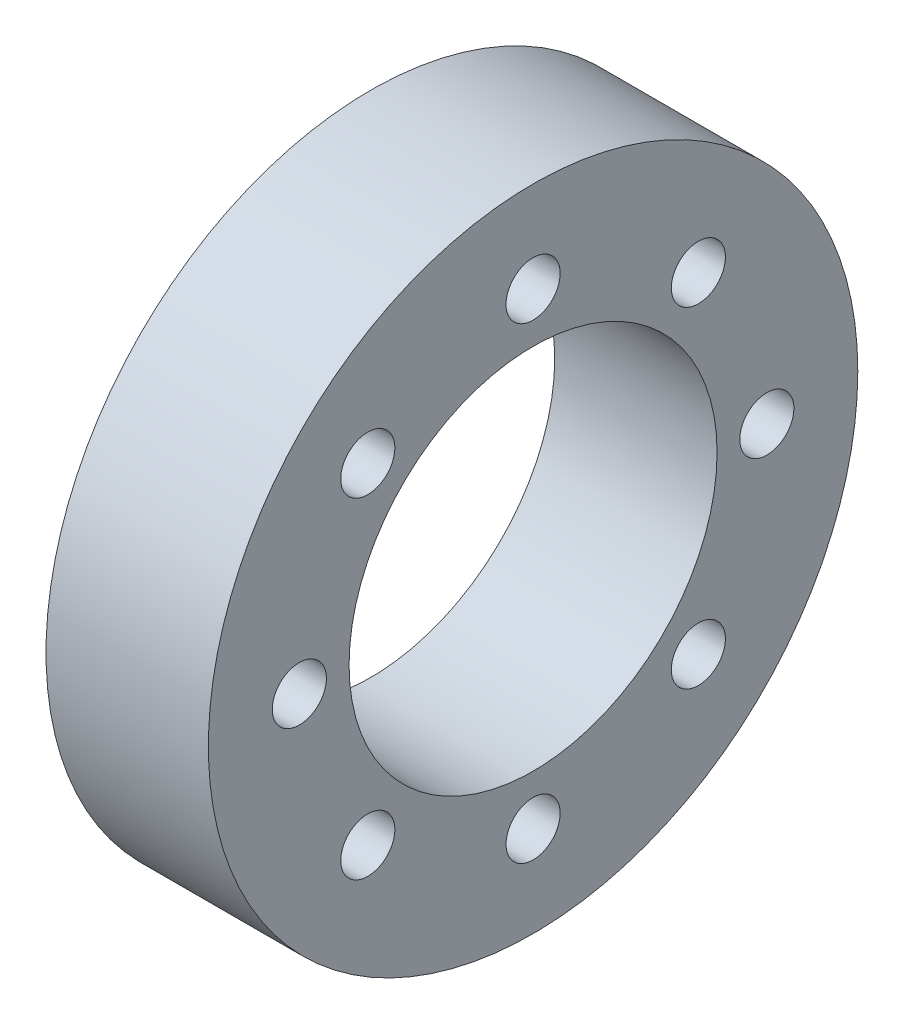
ISO-10303-21;
HEADER;
FILE_DESCRIPTION(('STEP AP214'),'2;1');
FILE_NAME('part.step','',(''),(''),'','','');
FILE_SCHEMA(('AUTOMOTIVE_DESIGN { 1 0 10303 214 1 1 1 1 }'));
ENDSEC;
DATA;
#1=APPLICATION_CONTEXT('core data for automotive mechanical design processes');
#2=APPLICATION_PROTOCOL_DEFINITION('international standard','automotive_design',2000,#1);
#3=PRODUCT_CONTEXT('',#1,'mechanical');
#4=PRODUCT('Part','Part','',(#3));
#5=PRODUCT_RELATED_PRODUCT_CATEGORY('part','',(#4));
#6=PRODUCT_DEFINITION_FORMATION('','',#4);
#7=PRODUCT_DEFINITION_CONTEXT('part definition',#1,'design');
#8=PRODUCT_DEFINITION('design','',#6,#7);
#9=PRODUCT_DEFINITION_SHAPE('','',#8);
#10=(LENGTH_UNIT() NAMED_UNIT(*) SI_UNIT(.MILLI.,.METRE.));
#11=(NAMED_UNIT(*) PLANE_ANGLE_UNIT() SI_UNIT($,.RADIAN.));
#12=(NAMED_UNIT(*) SI_UNIT($,.STERADIAN.) SOLID_ANGLE_UNIT());
#13=UNCERTAINTY_MEASURE_WITH_UNIT(LENGTH_MEASURE(1.E-05),#10,'distance_accuracy_value','');
#14=(GEOMETRIC_REPRESENTATION_CONTEXT(3) GLOBAL_UNCERTAINTY_ASSIGNED_CONTEXT((#13)) GLOBAL_UNIT_ASSIGNED_CONTEXT((#10,
#11,#12)) REPRESENTATION_CONTEXT('',''));
#15=CARTESIAN_POINT('',(0.,0.,0.));
#16=DIRECTION('',(0.,0.,1.));
#17=DIRECTION('',(1.,0.,0.));
#18=AXIS2_PLACEMENT_3D('',#15,#16,#17);
#19=CARTESIAN_POINT('',(-9.9823016,0.,0.));
#20=DIRECTION('',(-1.,0.,0.));
#21=DIRECTION('',(0.,0.,1.));
#22=AXIS2_PLACEMENT_3D('',#19,#20,#21);
#23=PLANE('',#22);
#24=CARTESIAN_POINT('',(-9.9823016,9.69698577429108,9.69698577429111));
#25=DIRECTION('',(-1.,0.,0.));
#26=DIRECTION('',(0.,0.,1.));
#27=AXIS2_PLACEMENT_3D('',#24,#25,#26);
#28=CIRCLE('',#27,1.5875);
#29=CARTESIAN_POINT('',(-9.9823016,9.69698577429108,11.2844857742911));
#30=VERTEX_POINT('',#29);
#31=EDGE_CURVE('E59',#30,#30,#28,.T.);
#32=ORIENTED_EDGE('',*,*,#31,.F.);
#33=EDGE_LOOP('',(#32));
#34=FACE_BOUND('',#33,.T.);
#35=CARTESIAN_POINT('',(-9.9823016,13.7136087961414,0.));
#36=DIRECTION('',(-1.,0.,0.));
#37=DIRECTION('',(0.,0.,1.));
#38=AXIS2_PLACEMENT_3D('',#35,#36,#37);
#39=CIRCLE('',#38,1.5875);
#40=CARTESIAN_POINT('',(-9.9823016,13.7136087961414,1.5875));
#41=VERTEX_POINT('',#40);
#42=EDGE_CURVE('E53',#41,#41,#39,.T.);
#43=ORIENTED_EDGE('',*,*,#42,.F.);
#44=EDGE_LOOP('',(#43));
#45=FACE_BOUND('',#44,.T.);
#46=CARTESIAN_POINT('',(-9.9823016,9.69698577429121,-9.69698577429098));
#47=DIRECTION('',(-1.,0.,0.));
#48=DIRECTION('',(0.,0.,1.));
#49=AXIS2_PLACEMENT_3D('',#46,#47,#48);
#50=CIRCLE('',#49,1.5875);
#51=CARTESIAN_POINT('',(-9.9823016,9.69698577429121,-8.10948577429098));
#52=VERTEX_POINT('',#51);
#53=EDGE_CURVE('E95',#52,#52,#50,.T.);
#54=ORIENTED_EDGE('',*,*,#53,.F.);
#55=EDGE_LOOP('',(#54));
#56=FACE_BOUND('',#55,.T.);
#57=CARTESIAN_POINT('',(-9.9823016,1.43642427599769E-13,-13.7136087961414));
#58=DIRECTION('',(-1.,0.,0.));
#59=DIRECTION('',(0.,0.,1.));
#60=AXIS2_PLACEMENT_3D('',#57,#58,#59);
#61=CIRCLE('',#60,1.5875);
#62=CARTESIAN_POINT('',(-9.9823016,1.43642427599769E-13,-12.1261087961414));
#63=VERTEX_POINT('',#62);
#64=EDGE_CURVE('E89',#63,#63,#61,.T.);
#65=ORIENTED_EDGE('',*,*,#64,.F.);
#66=EDGE_LOOP('',(#65));
#67=FACE_BOUND('',#66,.T.);
#68=CARTESIAN_POINT('',(-9.9823016,-9.69698577429101,-9.69698577429118));
#69=DIRECTION('',(-1.,0.,0.));
#70=DIRECTION('',(0.,0.,1.));
#71=AXIS2_PLACEMENT_3D('',#68,#69,#70);
#72=CIRCLE('',#71,1.5875);
#73=CARTESIAN_POINT('',(-9.9823016,-9.69698577429101,-8.10948577429118));
#74=VERTEX_POINT('',#73);
#75=EDGE_CURVE('E83',#74,#74,#72,.T.);
#76=ORIENTED_EDGE('',*,*,#75,.F.);
#77=EDGE_LOOP('',(#76));
#78=FACE_BOUND('',#77,.T.);
#79=CARTESIAN_POINT('',(-9.9823016,-13.7136087961414,0.));
#80=DIRECTION('',(-1.,0.,0.));
#81=DIRECTION('',(0.,0.,1.));
#82=AXIS2_PLACEMENT_3D('',#79,#80,#81);
#83=CIRCLE('',#82,1.5875);
#84=CARTESIAN_POINT('',(-9.9823016,-13.7136087961414,1.5875));
#85=VERTEX_POINT('',#84);
#86=EDGE_CURVE('E77',#85,#85,#83,.T.);
#87=ORIENTED_EDGE('',*,*,#86,.F.);
#88=EDGE_LOOP('',(#87));
#89=FACE_BOUND('',#88,.T.);
#90=CARTESIAN_POINT('',(-9.9823016,-9.69698577429114,9.69698577429104));
#91=DIRECTION('',(-1.,0.,0.));
#92=DIRECTION('',(0.,0.,1.));
#93=AXIS2_PLACEMENT_3D('',#90,#91,#92);
#94=CIRCLE('',#93,1.5875);
#95=CARTESIAN_POINT('',(-9.9823016,-9.69698577429114,11.284485774291));
#96=VERTEX_POINT('',#95);
#97=EDGE_CURVE('E71',#96,#96,#94,.T.);
#98=ORIENTED_EDGE('',*,*,#97,.F.);
#99=EDGE_LOOP('',(#98));
#100=FACE_BOUND('',#99,.T.);
#101=CARTESIAN_POINT('',(-9.9823016,0.,13.7136087961414));
#102=DIRECTION('',(-1.,0.,0.));
#103=DIRECTION('',(0.,0.,1.));
#104=AXIS2_PLACEMENT_3D('',#101,#102,#103);
#105=CIRCLE('',#104,1.5875);
#106=CARTESIAN_POINT('',(-9.9823016,0.,15.3011087961414));
#107=VERTEX_POINT('',#106);
#108=EDGE_CURVE('E65',#107,#107,#105,.T.);
#109=ORIENTED_EDGE('',*,*,#108,.F.);
#110=EDGE_LOOP('',(#109));
#111=FACE_BOUND('',#110,.T.);
#112=CARTESIAN_POINT('',(-9.9823016,0.,0.));
#113=DIRECTION('',(-1.,0.,0.));
#114=DIRECTION('',(0.,0.,1.));
#115=AXIS2_PLACEMENT_3D('',#112,#113,#114);
#116=CIRCLE('',#115,19.05);
#117=CARTESIAN_POINT('',(-9.9823016,0.,-19.05));
#118=VERTEX_POINT('',#117);
#119=EDGE_CURVE('E10',#118,#118,#116,.T.);
#120=ORIENTED_EDGE('',*,*,#119,.T.);
#121=EDGE_LOOP('',(#120));
#122=FACE_BOUND('',#121,.T.);
#123=CARTESIAN_POINT('',(-9.9823016,0.,0.));
#124=DIRECTION('',(-1.,0.,0.));
#125=DIRECTION('',(0.,0.,1.));
#126=AXIS2_PLACEMENT_3D('',#123,#124,#125);
#127=CIRCLE('',#126,10.795);
#128=CARTESIAN_POINT('',(-9.9823016,0.,10.795));
#129=VERTEX_POINT('',#128);
#130=EDGE_CURVE('E50',#129,#129,#127,.T.);
#131=ORIENTED_EDGE('',*,*,#130,.F.);
#132=EDGE_LOOP('',(#131));
#133=FACE_BOUND('',#132,.T.);
#134=ADVANCED_FACE('F35',(#34,#45,#56,#67,#78,#89,#100,#111,#122,#133),#23,.T.);
#135=CARTESIAN_POINT('',(-0.4573016,0.,0.));
#136=DIRECTION('',(-1.,0.,0.));
#137=DIRECTION('',(0.,0.,1.));
#138=AXIS2_PLACEMENT_3D('',#135,#136,#137);
#139=PLANE('',#138);
#140=CARTESIAN_POINT('',(-0.4573016,0.,13.7136087961414));
#141=DIRECTION('',(-1.,0.,0.));
#142=DIRECTION('',(0.,-1.,0.));
#143=AXIS2_PLACEMENT_3D('',#140,#141,#142);
#144=CIRCLE('',#143,1.5875);
#145=CARTESIAN_POINT('',(-0.4573016,-1.58750000000005,13.7136087961414));
#146=VERTEX_POINT('',#145);
#147=EDGE_CURVE('E68',#146,#146,#144,.T.);
#148=ORIENTED_EDGE('',*,*,#147,.T.);
#149=EDGE_LOOP('',(#148));
#150=FACE_BOUND('',#149,.T.);
#151=CARTESIAN_POINT('',(-0.4573016,-9.69698577429114,9.69698577429104));
#152=DIRECTION('',(-1.,0.,0.));
#153=DIRECTION('',(0.,-0.707106781186544,-0.707106781186551));
#154=AXIS2_PLACEMENT_3D('',#151,#152,#153);
#155=CIRCLE('',#154,1.5875);
#156=CARTESIAN_POINT('',(-0.4573016,-10.8195177894248,8.57445375915739));
#157=VERTEX_POINT('',#156);
#158=EDGE_CURVE('E74',#157,#157,#155,.T.);
#159=ORIENTED_EDGE('',*,*,#158,.T.);
#160=EDGE_LOOP('',(#159));
#161=FACE_BOUND('',#160,.T.);
#162=CARTESIAN_POINT('',(-0.4573016,-13.7136087961414,0.));
#163=DIRECTION('',(-1.,0.,0.));
#164=DIRECTION('',(0.,0.,-1.));
#165=AXIS2_PLACEMENT_3D('',#162,#163,#164);
#166=CIRCLE('',#165,1.5875);
#167=CARTESIAN_POINT('',(-0.4573016,-13.7136087961414,-1.5875));
#168=VERTEX_POINT('',#167);
#169=EDGE_CURVE('E80',#168,#168,#166,.T.);
#170=ORIENTED_EDGE('',*,*,#169,.T.);
#171=EDGE_LOOP('',(#170));
#172=FACE_BOUND('',#171,.T.);
#173=CARTESIAN_POINT('',(-0.4573016,-9.69698577429101,-9.69698577429118));
#174=DIRECTION('',(-1.,0.,0.));
#175=DIRECTION('',(0.,0.707106781186554,-0.707106781186541));
#176=AXIS2_PLACEMENT_3D('',#173,#174,#175);
#177=CIRCLE('',#176,1.5875);
#178=CARTESIAN_POINT('',(-0.4573016,-8.57445375915736,-10.8195177894248));
#179=VERTEX_POINT('',#178);
#180=EDGE_CURVE('E86',#179,#179,#177,.T.);
#181=ORIENTED_EDGE('',*,*,#180,.T.);
#182=EDGE_LOOP('',(#181));
#183=FACE_BOUND('',#182,.T.);
#184=CARTESIAN_POINT('',(-0.4573016,1.43642427599769E-13,-13.7136087961414));
#185=DIRECTION('',(-1.,0.,0.));
#186=DIRECTION('',(0.,1.,0.));
#187=AXIS2_PLACEMENT_3D('',#184,#185,#186);
#188=CIRCLE('',#187,1.5875);
#189=CARTESIAN_POINT('',(-0.4573016,1.58750000000014,-13.7136087961414));
#190=VERTEX_POINT('',#189);
#191=EDGE_CURVE('E92',#190,#190,#188,.T.);
#192=ORIENTED_EDGE('',*,*,#191,.T.);
#193=EDGE_LOOP('',(#192));
#194=FACE_BOUND('',#193,.T.);
#195=CARTESIAN_POINT('',(-0.4573016,9.69698577429121,-9.69698577429098));
#196=DIRECTION('',(-1.,0.,0.));
#197=DIRECTION('',(0.,0.707106781186539,0.707106781186556));
#198=AXIS2_PLACEMENT_3D('',#195,#196,#197);
#199=CIRCLE('',#198,1.5875);
#200=CARTESIAN_POINT('',(-0.4573016,10.8195177894248,-8.57445375915732));
#201=VERTEX_POINT('',#200);
#202=EDGE_CURVE('E98',#201,#201,#199,.T.);
#203=ORIENTED_EDGE('',*,*,#202,.T.);
#204=EDGE_LOOP('',(#203));
#205=FACE_BOUND('',#204,.T.);
#206=CARTESIAN_POINT('',(-0.4573016,13.7136087961414,0.));
#207=DIRECTION('',(-1.,0.,0.));
#208=DIRECTION('',(0.,0.,1.));
#209=AXIS2_PLACEMENT_3D('',#206,#207,#208);
#210=CIRCLE('',#209,1.5875);
#211=CARTESIAN_POINT('',(-0.4573016,13.7136087961414,1.5875));
#212=VERTEX_POINT('',#211);
#213=EDGE_CURVE('E56',#212,#212,#210,.T.);
#214=ORIENTED_EDGE('',*,*,#213,.T.);
#215=EDGE_LOOP('',(#214));
#216=FACE_BOUND('',#215,.T.);
#217=CARTESIAN_POINT('',(-0.4573016,9.69698577429108,9.69698577429111));
#218=DIRECTION('',(-1.,0.,0.));
#219=DIRECTION('',(0.,-0.707106781186549,0.707106781186546));
#220=AXIS2_PLACEMENT_3D('',#217,#218,#219);
#221=CIRCLE('',#220,1.5875);
#222=CARTESIAN_POINT('',(-0.4573016,8.57445375915743,10.8195177894248));
#223=VERTEX_POINT('',#222);
#224=EDGE_CURVE('E62',#223,#223,#221,.T.);
#225=ORIENTED_EDGE('',*,*,#224,.T.);
#226=EDGE_LOOP('',(#225));
#227=FACE_BOUND('',#226,.T.);
#228=CARTESIAN_POINT('',(-0.4573016,0.,0.));
#229=DIRECTION('',(-1.,0.,0.));
#230=DIRECTION('',(0.,0.,1.));
#231=AXIS2_PLACEMENT_3D('',#228,#229,#230);
#232=CIRCLE('',#231,19.05);
#233=CARTESIAN_POINT('',(-0.4573016,0.,-19.05));
#234=VERTEX_POINT('',#233);
#235=EDGE_CURVE('E39',#234,#234,#232,.T.);
#236=ORIENTED_EDGE('',*,*,#235,.F.);
#237=EDGE_LOOP('',(#236));
#238=FACE_BOUND('',#237,.T.);
#239=CARTESIAN_POINT('',(-0.457301600000001,0.,0.));
#240=DIRECTION('',(-1.,0.,0.));
#241=DIRECTION('',(0.,0.,1.));
#242=AXIS2_PLACEMENT_3D('',#239,#240,#241);
#243=CIRCLE('',#242,10.795);
#244=CARTESIAN_POINT('',(-0.457301600000001,0.,10.795));
#245=VERTEX_POINT('',#244);
#246=EDGE_CURVE('E46',#245,#245,#243,.F.);
#247=ORIENTED_EDGE('',*,*,#246,.F.);
#248=EDGE_LOOP('',(#247));
#249=FACE_BOUND('',#248,.T.);
#250=ADVANCED_FACE('F102',(#150,#161,#172,#183,#194,#205,#216,#227,#238,#249),#139,.F.);
#251=CARTESIAN_POINT('',(-9.9823016,0.,0.));
#252=DIRECTION('',(1.,0.,0.));
#253=DIRECTION('',(0.,0.,-1.));
#254=AXIS2_PLACEMENT_3D('',#251,#252,#253);
#255=CYLINDRICAL_SURFACE('',#254,19.05);
#256=CARTESIAN_POINT('',(-9.9823016,0.,-19.05));
#257=CARTESIAN_POINT('',(-9.88308285,0.,-19.05));
#258=CARTESIAN_POINT('',(-9.7838641,0.,-19.05));
#259=CARTESIAN_POINT('',(-9.5854266,0.,-19.05));
#260=CARTESIAN_POINT('',(-9.48620785,0.,-19.05));
#261=CARTESIAN_POINT('',(-9.28777035,0.,-19.05));
#262=CARTESIAN_POINT('',(-9.1885516,0.,-19.05));
#263=CARTESIAN_POINT('',(-8.9901141,0.,-19.05));
#264=CARTESIAN_POINT('',(-8.89089535,0.,-19.05));
#265=CARTESIAN_POINT('',(-8.69245785,0.,-19.05));
#266=CARTESIAN_POINT('',(-8.5932391,0.,-19.05));
#267=CARTESIAN_POINT('',(-8.3948016,0.,-19.05));
#268=CARTESIAN_POINT('',(-8.29558285,0.,-19.05));
#269=CARTESIAN_POINT('',(-8.09714535,0.,-19.05));
#270=CARTESIAN_POINT('',(-7.9979266,0.,-19.05));
#271=CARTESIAN_POINT('',(-7.7994891,0.,-19.05));
#272=CARTESIAN_POINT('',(-7.70027035,0.,-19.05));
#273=CARTESIAN_POINT('',(-7.50183285,0.,-19.05));
#274=CARTESIAN_POINT('',(-7.4026141,0.,-19.05));
#275=CARTESIAN_POINT('',(-7.2041766,0.,-19.05));
#276=CARTESIAN_POINT('',(-7.10495785,0.,-19.05));
#277=CARTESIAN_POINT('',(-6.90652035,0.,-19.05));
#278=CARTESIAN_POINT('',(-6.8073016,0.,-19.05));
#279=CARTESIAN_POINT('',(-6.6088641,0.,-19.05));
#280=CARTESIAN_POINT('',(-6.50964535,0.,-19.05));
#281=CARTESIAN_POINT('',(-6.31120785,0.,-19.05));
#282=CARTESIAN_POINT('',(-6.2119891,0.,-19.05));
#283=CARTESIAN_POINT('',(-6.0135516,0.,-19.05));
#284=CARTESIAN_POINT('',(-5.91433285,0.,-19.05));
#285=CARTESIAN_POINT('',(-5.71589535,0.,-19.05));
#286=CARTESIAN_POINT('',(-5.6166766,0.,-19.05));
#287=CARTESIAN_POINT('',(-5.4182391,0.,-19.05));
#288=CARTESIAN_POINT('',(-5.31902035,0.,-19.05));
#289=CARTESIAN_POINT('',(-5.12058285,0.,-19.05));
#290=CARTESIAN_POINT('',(-5.0213641,0.,-19.05));
#291=CARTESIAN_POINT('',(-4.8229266,0.,-19.05));
#292=CARTESIAN_POINT('',(-4.72370785,0.,-19.05));
#293=CARTESIAN_POINT('',(-4.52527035,0.,-19.05));
#294=CARTESIAN_POINT('',(-4.4260516,0.,-19.05));
#295=CARTESIAN_POINT('',(-4.2276141,0.,-19.05));
#296=CARTESIAN_POINT('',(-4.12839535,0.,-19.05));
#297=CARTESIAN_POINT('',(-3.92995785,0.,-19.05));
#298=CARTESIAN_POINT('',(-3.8307391,0.,-19.05));
#299=CARTESIAN_POINT('',(-3.6323016,0.,-19.05));
#300=CARTESIAN_POINT('',(-3.53308285,0.,-19.05));
#301=CARTESIAN_POINT('',(-3.33464535,0.,-19.05));
#302=CARTESIAN_POINT('',(-3.2354266,0.,-19.05));
#303=CARTESIAN_POINT('',(-3.0369891,0.,-19.05));
#304=CARTESIAN_POINT('',(-2.93777035,0.,-19.05));
#305=CARTESIAN_POINT('',(-2.73933285,0.,-19.05));
#306=CARTESIAN_POINT('',(-2.6401141,0.,-19.05));
#307=CARTESIAN_POINT('',(-2.4416766,0.,-19.05));
#308=CARTESIAN_POINT('',(-2.34245785,0.,-19.05));
#309=CARTESIAN_POINT('',(-2.14402035,0.,-19.05));
#310=CARTESIAN_POINT('',(-2.0448016,0.,-19.05));
#311=CARTESIAN_POINT('',(-1.8463641,0.,-19.05));
#312=CARTESIAN_POINT('',(-1.74714535,0.,-19.05));
#313=CARTESIAN_POINT('',(-1.54870785,0.,-19.05));
#314=CARTESIAN_POINT('',(-1.4494891,0.,-19.05));
#315=CARTESIAN_POINT('',(-1.2510516,0.,-19.05));
#316=CARTESIAN_POINT('',(-1.15183285,0.,-19.05));
#317=CARTESIAN_POINT('',(-0.95339535,0.,-19.05));
#318=CARTESIAN_POINT('',(-0.8541766,0.,-19.05));
#319=CARTESIAN_POINT('',(-0.6557391,0.,-19.05));
#320=CARTESIAN_POINT('',(-0.55652035,0.,-19.05));
#321=CARTESIAN_POINT('',(-0.4573016,0.,-19.05));
#322=B_SPLINE_CURVE_WITH_KNOTS('',3,(#256,#257,#258,#259,#260,#261,#262,#263,#264,#265,#266,
#267,#268,#269,#270,#271,#272,#273,#274,#275,#276,#277,#278,#279,#280,#281,#282,#283,#284,#285,
#286,#287,#288,#289,#290,#291,#292,#293,#294,#295,#296,#297,#298,#299,#300,#301,#302,#303,#304,
#305,#306,#307,#308,#309,#310,#311,#312,#313,#314,#315,#316,#317,#318,#319,#320,#321),
.UNSPECIFIED.,.F.,.F.,(4,2,2,2,2,2,2,2,2,2,2,2,2,2,2,2,2,2,2,2,2,2,2,2,2,2,2,2,2,2,2,2,4),(0.,
0.29765625,0.5953125,0.892968750000001,1.190625,1.48828125,1.7859375,2.08359375,2.38125,
2.67890625,2.9765625,3.27421875,3.571875,3.86953125,4.1671875,4.46484375,4.7625,5.06015625,
5.3578125,5.65546875,5.953125,6.25078125,6.5484375,6.84609375,7.14375,7.44140625,7.7390625,
8.03671875,8.334375,8.63203125,8.9296875,9.22734375,9.525),.UNSPECIFIED.);
#323=EDGE_CURVE('BSEAM37',#118,#234,#322,.T.);
#324=ORIENTED_EDGE('',*,*,#119,.F.);
#325=ORIENTED_EDGE('',*,*,#235,.T.);
#326=ORIENTED_EDGE('',*,*,#323,.T.);
#327=ORIENTED_EDGE('',*,*,#323,.F.);
#328=EDGE_LOOP('',(#324,#326,#325,#327));
#329=FACE_BOUND('',#328,.T.);
#330=ADVANCED_FACE('F37',(#329),#255,.T.);
#331=CARTESIAN_POINT('',(53.4242351264149,0.,0.));
#332=DIRECTION('',(-1.,0.,0.));
#333=DIRECTION('',(0.,0.,1.));
#334=AXIS2_PLACEMENT_3D('',#331,#332,#333);
#335=CYLINDRICAL_SURFACE('',#334,10.795);
#336=ORIENTED_EDGE('',*,*,#246,.T.);
#337=EDGE_LOOP('',(#336));
#338=FACE_BOUND('',#337,.T.);
#339=ORIENTED_EDGE('',*,*,#130,.T.);
#340=EDGE_LOOP('',(#339));
#341=FACE_BOUND('',#340,.T.);
#342=ADVANCED_FACE('F128',(#338,#341),#335,.F.);
#343=CARTESIAN_POINT('',(-14.4724296605346,13.7136087961414,0.));
#344=DIRECTION('',(1.,0.,0.));
#345=DIRECTION('',(0.,0.,-1.));
#346=AXIS2_PLACEMENT_3D('',#343,#344,#345);
#347=CYLINDRICAL_SURFACE('',#346,1.5875);
#348=ORIENTED_EDGE('',*,*,#213,.F.);
#349=EDGE_LOOP('',(#348));
#350=FACE_BOUND('',#349,.T.);
#351=ORIENTED_EDGE('',*,*,#42,.T.);
#352=EDGE_LOOP('',(#351));
#353=FACE_BOUND('',#352,.T.);
#354=ADVANCED_FACE('F130',(#350,#353),#347,.F.);
#355=CARTESIAN_POINT('',(-14.4724296605346,9.69698577429108,9.69698577429111));
#356=DIRECTION('',(1.,0.,0.));
#357=DIRECTION('',(0.,0.,-1.));
#358=AXIS2_PLACEMENT_3D('',#355,#356,#357);
#359=CYLINDRICAL_SURFACE('',#358,1.5875);
#360=ORIENTED_EDGE('',*,*,#224,.F.);
#361=EDGE_LOOP('',(#360));
#362=FACE_BOUND('',#361,.T.);
#363=ORIENTED_EDGE('',*,*,#31,.T.);
#364=EDGE_LOOP('',(#363));
#365=FACE_BOUND('',#364,.T.);
#366=ADVANCED_FACE('F137',(#362,#365),#359,.F.);
#367=CARTESIAN_POINT('',(-14.4724296605346,0.,13.7136087961414));
#368=DIRECTION('',(1.,0.,0.));
#369=DIRECTION('',(0.,0.,-1.));
#370=AXIS2_PLACEMENT_3D('',#367,#368,#369);
#371=CYLINDRICAL_SURFACE('',#370,1.5875);
#372=ORIENTED_EDGE('',*,*,#147,.F.);
#373=EDGE_LOOP('',(#372));
#374=FACE_BOUND('',#373,.T.);
#375=ORIENTED_EDGE('',*,*,#108,.T.);
#376=EDGE_LOOP('',(#375));
#377=FACE_BOUND('',#376,.T.);
#378=ADVANCED_FACE('F173',(#374,#377),#371,.F.);
#379=CARTESIAN_POINT('',(-14.4724296605346,-9.69698577429114,9.69698577429104));
#380=DIRECTION('',(1.,0.,0.));
#381=DIRECTION('',(0.,0.,-1.));
#382=AXIS2_PLACEMENT_3D('',#379,#380,#381);
#383=CYLINDRICAL_SURFACE('',#382,1.5875);
#384=ORIENTED_EDGE('',*,*,#158,.F.);
#385=EDGE_LOOP('',(#384));
#386=FACE_BOUND('',#385,.T.);
#387=ORIENTED_EDGE('',*,*,#97,.T.);
#388=EDGE_LOOP('',(#387));
#389=FACE_BOUND('',#388,.T.);
#390=ADVANCED_FACE('F169',(#386,#389),#383,.F.);
#391=CARTESIAN_POINT('',(-14.4724296605346,-13.7136087961414,0.));
#392=DIRECTION('',(1.,0.,0.));
#393=DIRECTION('',(0.,0.,-1.));
#394=AXIS2_PLACEMENT_3D('',#391,#392,#393);
#395=CYLINDRICAL_SURFACE('',#394,1.5875);
#396=ORIENTED_EDGE('',*,*,#169,.F.);
#397=EDGE_LOOP('',(#396));
#398=FACE_BOUND('',#397,.T.);
#399=ORIENTED_EDGE('',*,*,#86,.T.);
#400=EDGE_LOOP('',(#399));
#401=FACE_BOUND('',#400,.T.);
#402=ADVANCED_FACE('F163',(#398,#401),#395,.F.);
#403=CARTESIAN_POINT('',(-14.4724296605346,-9.69698577429101,-9.69698577429118));
#404=DIRECTION('',(1.,0.,0.));
#405=DIRECTION('',(0.,0.,-1.));
#406=AXIS2_PLACEMENT_3D('',#403,#404,#405);
#407=CYLINDRICAL_SURFACE('',#406,1.5875);
#408=ORIENTED_EDGE('',*,*,#180,.F.);
#409=EDGE_LOOP('',(#408));
#410=FACE_BOUND('',#409,.T.);
#411=ORIENTED_EDGE('',*,*,#75,.T.);
#412=EDGE_LOOP('',(#411));
#413=FACE_BOUND('',#412,.T.);
#414=ADVANCED_FACE('F158',(#410,#413),#407,.F.);
#415=CARTESIAN_POINT('',(-14.4724296605346,1.43642427599769E-13,-13.7136087961414));
#416=DIRECTION('',(1.,0.,0.));
#417=DIRECTION('',(0.,0.,-1.));
#418=AXIS2_PLACEMENT_3D('',#415,#416,#417);
#419=CYLINDRICAL_SURFACE('',#418,1.5875);
#420=ORIENTED_EDGE('',*,*,#191,.F.);
#421=EDGE_LOOP('',(#420));
#422=FACE_BOUND('',#421,.T.);
#423=ORIENTED_EDGE('',*,*,#64,.T.);
#424=EDGE_LOOP('',(#423));
#425=FACE_BOUND('',#424,.T.);
#426=ADVANCED_FACE('F108',(#422,#425),#419,.F.);
#427=CARTESIAN_POINT('',(-14.4724296605346,9.69698577429121,-9.69698577429098));
#428=DIRECTION('',(1.,0.,0.));
#429=DIRECTION('',(0.,0.,-1.));
#430=AXIS2_PLACEMENT_3D('',#427,#428,#429);
#431=CYLINDRICAL_SURFACE('',#430,1.5875);
#432=ORIENTED_EDGE('',*,*,#202,.F.);
#433=EDGE_LOOP('',(#432));
#434=FACE_BOUND('',#433,.T.);
#435=ORIENTED_EDGE('',*,*,#53,.T.);
#436=EDGE_LOOP('',(#435));
#437=FACE_BOUND('',#436,.T.);
#438=ADVANCED_FACE('F105',(#434,#437),#431,.F.);
#439=CLOSED_SHELL('',(#134,#250,#330,#342,#354,#366,#378,#390,#402,#414,#426,#438));
#440=MANIFOLD_SOLID_BREP('B2',#439);
#441=ADVANCED_BREP_SHAPE_REPRESENTATION('',(#18,#440),#14);
#442=SHAPE_DEFINITION_REPRESENTATION(#9,#441);
ENDSEC;
END-ISO-10303-21;
